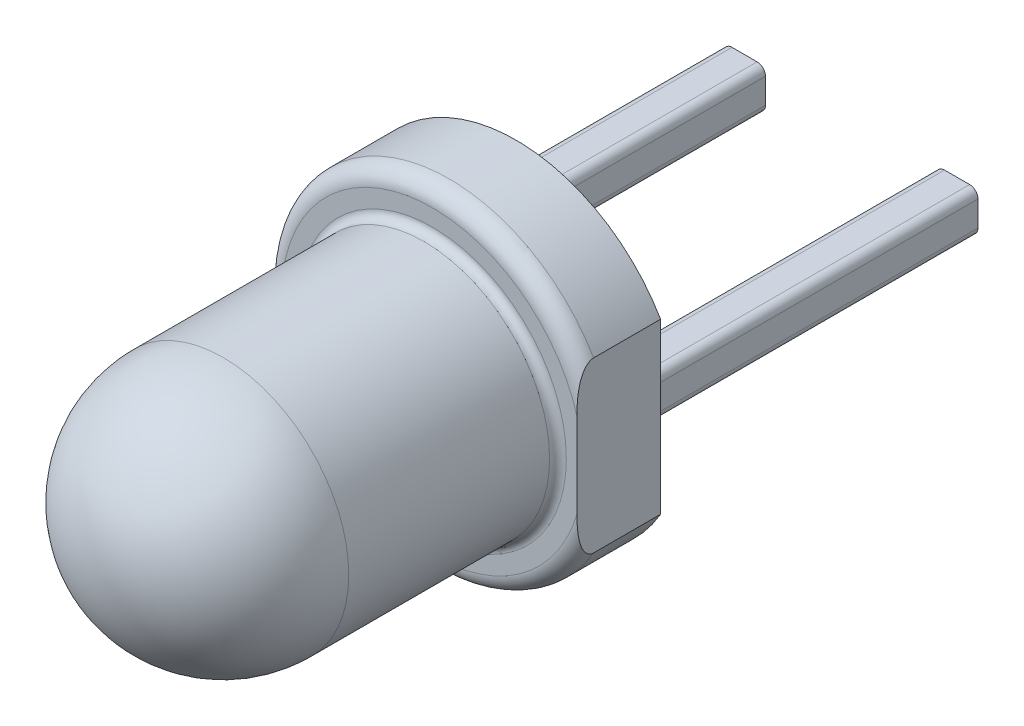
ISO-10303-21;
HEADER;
FILE_DESCRIPTION(('STEP AP214'),'2;1');
FILE_NAME('part.step','',(''),(''),'','','');
FILE_SCHEMA(('AUTOMOTIVE_DESIGN { 1 0 10303 214 1 1 1 1 }'));
ENDSEC;
DATA;
#1=APPLICATION_CONTEXT('core data for automotive mechanical design processes');
#2=APPLICATION_PROTOCOL_DEFINITION('international standard','automotive_design',2000,#1);
#3=PRODUCT_CONTEXT('',#1,'mechanical');
#4=PRODUCT('Part','Part','',(#3));
#5=PRODUCT_RELATED_PRODUCT_CATEGORY('part','',(#4));
#6=PRODUCT_DEFINITION_FORMATION('','',#4);
#7=PRODUCT_DEFINITION_CONTEXT('part definition',#1,'design');
#8=PRODUCT_DEFINITION('design','',#6,#7);
#9=PRODUCT_DEFINITION_SHAPE('','',#8);
#10=(LENGTH_UNIT() NAMED_UNIT(*) SI_UNIT(.MILLI.,.METRE.));
#11=(NAMED_UNIT(*) PLANE_ANGLE_UNIT() SI_UNIT($,.RADIAN.));
#12=(NAMED_UNIT(*) SI_UNIT($,.STERADIAN.) SOLID_ANGLE_UNIT());
#13=UNCERTAINTY_MEASURE_WITH_UNIT(LENGTH_MEASURE(1.E-05),#10,'distance_accuracy_value','');
#14=(GEOMETRIC_REPRESENTATION_CONTEXT(3) GLOBAL_UNCERTAINTY_ASSIGNED_CONTEXT((#13)) GLOBAL_UNIT_ASSIGNED_CONTEXT((#10,
#11,#12)) REPRESENTATION_CONTEXT('',''));
#15=CARTESIAN_POINT('',(0.,0.,0.));
#16=DIRECTION('',(0.,0.,1.));
#17=DIRECTION('',(1.,0.,0.));
#18=AXIS2_PLACEMENT_3D('',#15,#16,#17);
#19=CARTESIAN_POINT('',(0.,0.,0.));
#20=DIRECTION('',(0.,0.,1.));
#21=DIRECTION('',(1.,0.,0.));
#22=AXIS2_PLACEMENT_3D('',#19,#20,#21);
#23=PLANE('',#22);
#24=DIRECTION('',(0.,1.,0.));
#25=VECTOR('',#24,1.);
#26=CARTESIAN_POINT('',(-1.52,-0.25,0.));
#27=LINE('',#26,#25);
#28=CARTESIAN_POINT('',(-1.52,-0.15,0.));
#29=VERTEX_POINT('',#28);
#30=CARTESIAN_POINT('',(-1.52,0.15,0.));
#31=VERTEX_POINT('',#30);
#32=EDGE_CURVE('E282',#29,#31,#27,.T.);
#33=ORIENTED_EDGE('',*,*,#32,.F.);
#34=CARTESIAN_POINT('',(-1.42,-0.15,0.));
#35=DIRECTION('',(0.,0.,1.));
#36=DIRECTION('',(1.,0.,0.));
#37=AXIS2_PLACEMENT_3D('',#34,#35,#36);
#38=CIRCLE('',#37,0.1);
#39=CARTESIAN_POINT('',(-1.42,-0.25,0.));
#40=VERTEX_POINT('',#39);
#41=EDGE_CURVE('E268',#29,#40,#38,.T.);
#42=ORIENTED_EDGE('',*,*,#41,.T.);
#43=DIRECTION('',(-1.,0.,0.));
#44=VECTOR('',#43,1.);
#45=CARTESIAN_POINT('',(-1.02,-0.25,0.));
#46=LINE('',#45,#44);
#47=CARTESIAN_POINT('',(-1.12,-0.25,0.));
#48=VERTEX_POINT('',#47);
#49=EDGE_CURVE('E293',#48,#40,#46,.T.);
#50=ORIENTED_EDGE('',*,*,#49,.F.);
#51=CARTESIAN_POINT('',(-1.12,-0.15,0.));
#52=DIRECTION('',(0.,0.,1.));
#53=DIRECTION('',(1.,0.,0.));
#54=AXIS2_PLACEMENT_3D('',#51,#52,#53);
#55=CIRCLE('',#54,0.1);
#56=CARTESIAN_POINT('',(-1.02,-0.15,0.));
#57=VERTEX_POINT('',#56);
#58=EDGE_CURVE('E270',#48,#57,#55,.T.);
#59=ORIENTED_EDGE('',*,*,#58,.T.);
#60=DIRECTION('',(0.,-1.,0.));
#61=VECTOR('',#60,1.);
#62=CARTESIAN_POINT('',(-1.02,-0.25,0.));
#63=LINE('',#62,#61);
#64=CARTESIAN_POINT('',(-1.02,0.15,0.));
#65=VERTEX_POINT('',#64);
#66=EDGE_CURVE('E305',#65,#57,#63,.T.);
#67=ORIENTED_EDGE('',*,*,#66,.F.);
#68=CARTESIAN_POINT('',(-1.12,0.15,0.));
#69=DIRECTION('',(0.,0.,1.));
#70=DIRECTION('',(1.,0.,0.));
#71=AXIS2_PLACEMENT_3D('',#68,#69,#70);
#72=CIRCLE('',#71,0.1);
#73=CARTESIAN_POINT('',(-1.12,0.25,0.));
#74=VERTEX_POINT('',#73);
#75=EDGE_CURVE('E272',#65,#74,#72,.T.);
#76=ORIENTED_EDGE('',*,*,#75,.T.);
#77=DIRECTION('',(1.,0.,0.));
#78=VECTOR('',#77,1.);
#79=CARTESIAN_POINT('',(-1.02,0.25,0.));
#80=LINE('',#79,#78);
#81=CARTESIAN_POINT('',(-1.42,0.25,0.));
#82=VERTEX_POINT('',#81);
#83=EDGE_CURVE('E285',#82,#74,#80,.T.);
#84=ORIENTED_EDGE('',*,*,#83,.F.);
#85=CARTESIAN_POINT('',(-1.42,0.15,0.));
#86=DIRECTION('',(0.,0.,1.));
#87=DIRECTION('',(1.,0.,0.));
#88=AXIS2_PLACEMENT_3D('',#85,#86,#87);
#89=CIRCLE('',#88,0.1);
#90=EDGE_CURVE('E264',#82,#31,#89,.T.);
#91=ORIENTED_EDGE('',*,*,#90,.T.);
#92=EDGE_LOOP('',(#33,#42,#50,#59,#67,#76,#84,#91));
#93=FACE_BOUND('',#92,.T.);
#94=DIRECTION('',(0.,1.,0.));
#95=VECTOR('',#94,1.);
#96=CARTESIAN_POINT('',(1.02,-0.25,0.));
#97=LINE('',#96,#95);
#98=CARTESIAN_POINT('',(1.02,-0.15,0.));
#99=VERTEX_POINT('',#98);
#100=CARTESIAN_POINT('',(1.02,0.15,0.));
#101=VERTEX_POINT('',#100);
#102=EDGE_CURVE('E301',#99,#101,#97,.T.);
#103=ORIENTED_EDGE('',*,*,#102,.F.);
#104=CARTESIAN_POINT('',(1.12,-0.15,0.));
#105=DIRECTION('',(0.,0.,1.));
#106=DIRECTION('',(1.,0.,0.));
#107=AXIS2_PLACEMENT_3D('',#104,#105,#106);
#108=CIRCLE('',#107,0.1);
#109=CARTESIAN_POINT('',(1.12,-0.25,0.));
#110=VERTEX_POINT('',#109);
#111=EDGE_CURVE('E274',#99,#110,#108,.T.);
#112=ORIENTED_EDGE('',*,*,#111,.T.);
#113=DIRECTION('',(-1.,0.,0.));
#114=VECTOR('',#113,1.);
#115=CARTESIAN_POINT('',(1.52,-0.25,0.));
#116=LINE('',#115,#114);
#117=CARTESIAN_POINT('',(1.42,-0.25,0.));
#118=VERTEX_POINT('',#117);
#119=EDGE_CURVE('E196',#118,#110,#116,.T.);
#120=ORIENTED_EDGE('',*,*,#119,.F.);
#121=CARTESIAN_POINT('',(1.42,-0.15,0.));
#122=DIRECTION('',(0.,0.,1.));
#123=DIRECTION('',(1.,0.,0.));
#124=AXIS2_PLACEMENT_3D('',#121,#122,#123);
#125=CIRCLE('',#124,0.1);
#126=CARTESIAN_POINT('',(1.52,-0.15,0.));
#127=VERTEX_POINT('',#126);
#128=EDGE_CURVE('E62',#118,#127,#125,.T.);
#129=ORIENTED_EDGE('',*,*,#128,.T.);
#130=DIRECTION('',(0.,-1.,0.));
#131=VECTOR('',#130,1.);
#132=CARTESIAN_POINT('',(1.52,-0.25,0.));
#133=LINE('',#132,#131);
#134=CARTESIAN_POINT('',(1.52,0.15,0.));
#135=VERTEX_POINT('',#134);
#136=EDGE_CURVE('E322',#135,#127,#133,.T.);
#137=ORIENTED_EDGE('',*,*,#136,.F.);
#138=CARTESIAN_POINT('',(1.42,0.15,0.));
#139=DIRECTION('',(0.,0.,1.));
#140=DIRECTION('',(1.,0.,0.));
#141=AXIS2_PLACEMENT_3D('',#138,#139,#140);
#142=CIRCLE('',#141,0.1);
#143=CARTESIAN_POINT('',(1.42,0.25,0.));
#144=VERTEX_POINT('',#143);
#145=EDGE_CURVE('E276',#135,#144,#142,.T.);
#146=ORIENTED_EDGE('',*,*,#145,.T.);
#147=DIRECTION('',(1.,0.,0.));
#148=VECTOR('',#147,1.);
#149=CARTESIAN_POINT('',(1.52,0.25,0.));
#150=LINE('',#149,#148);
#151=CARTESIAN_POINT('',(1.12,0.25,0.));
#152=VERTEX_POINT('',#151);
#153=EDGE_CURVE('E320',#152,#144,#150,.T.);
#154=ORIENTED_EDGE('',*,*,#153,.F.);
#155=CARTESIAN_POINT('',(1.12,0.15,0.));
#156=DIRECTION('',(0.,0.,1.));
#157=DIRECTION('',(1.,0.,0.));
#158=AXIS2_PLACEMENT_3D('',#155,#156,#157);
#159=CIRCLE('',#158,0.1);
#160=EDGE_CURVE('E266',#152,#101,#159,.T.);
#161=ORIENTED_EDGE('',*,*,#160,.T.);
#162=EDGE_LOOP('',(#103,#112,#120,#129,#137,#146,#154,#161));
#163=FACE_BOUND('',#162,.T.);
#164=DIRECTION('',(0.,-1.,0.));
#165=VECTOR('',#164,1.);
#166=CARTESIAN_POINT('',(1.72664300141917,0.,0.));
#167=LINE('',#166,#165);
#168=CARTESIAN_POINT('',(1.72664300141917,1.0093086473672,0.));
#169=VERTEX_POINT('',#168);
#170=CARTESIAN_POINT('',(1.72664300141917,-1.0093086473672,0.));
#171=VERTEX_POINT('',#170);
#172=EDGE_CURVE('E169',#169,#171,#167,.T.);
#173=ORIENTED_EDGE('',*,*,#172,.T.);
#174=CARTESIAN_POINT('',(0.,0.,0.));
#175=DIRECTION('',(0.,0.,1.));
#176=DIRECTION('',(1.,0.,0.));
#177=AXIS2_PLACEMENT_3D('',#174,#175,#176);
#178=CIRCLE('',#177,2.);
#179=EDGE_CURVE('E182',#169,#171,#178,.T.);
#180=ORIENTED_EDGE('',*,*,#179,.F.);
#181=EDGE_LOOP('',(#173,#180));
#182=FACE_BOUND('',#181,.T.);
#183=ADVANCED_FACE('F34',(#93,#163,#182),#23,.F.);
#184=CARTESIAN_POINT('',(0.,0.,1.));
#185=DIRECTION('',(0.,0.,-1.));
#186=DIRECTION('',(-1.,0.,0.));
#187=AXIS2_PLACEMENT_3D('',#184,#185,#186);
#188=CYLINDRICAL_SURFACE('',#187,2.);
#189=DIRECTION('',(0.,0.,-1.));
#190=VECTOR('',#189,1.);
#191=CARTESIAN_POINT('',(1.72664300141917,-1.0093086473672,5.));
#192=LINE('',#191,#190);
#193=CARTESIAN_POINT('',(1.72664300141917,-1.0093086473672,0.8));
#194=VERTEX_POINT('',#193);
#195=EDGE_CURVE('E174',#194,#171,#192,.T.);
#196=ORIENTED_EDGE('',*,*,#195,.F.);
#197=CARTESIAN_POINT('',(0.,0.,0.8));
#198=DIRECTION('',(0.,0.,1.));
#199=DIRECTION('',(1.,0.,0.));
#200=AXIS2_PLACEMENT_3D('',#197,#198,#199);
#201=CIRCLE('',#200,2.);
#202=CARTESIAN_POINT('',(1.72664300141917,1.0093086473672,0.8));
#203=VERTEX_POINT('',#202);
#204=EDGE_CURVE('E184',#194,#203,#201,.F.);
#205=ORIENTED_EDGE('',*,*,#204,.T.);
#206=DIRECTION('',(0.,0.,-1.));
#207=VECTOR('',#206,1.);
#208=CARTESIAN_POINT('',(1.72664300141917,1.0093086473672,5.));
#209=LINE('',#208,#207);
#210=EDGE_CURVE('E172',#203,#169,#209,.T.);
#211=ORIENTED_EDGE('',*,*,#210,.T.);
#212=ORIENTED_EDGE('',*,*,#179,.T.);
#213=EDGE_LOOP('',(#196,#205,#211,#212));
#214=FACE_BOUND('',#213,.T.);
#215=ADVANCED_FACE('F181',(#214),#188,.T.);
#216=CARTESIAN_POINT('',(0.,0.,1.));
#217=DIRECTION('',(0.,0.,1.));
#218=DIRECTION('',(1.,0.,0.));
#219=AXIS2_PLACEMENT_3D('',#216,#217,#218);
#220=PLANE('',#219);
#221=CARTESIAN_POINT('',(0.,0.,1.));
#222=DIRECTION('',(0.,0.,1.));
#223=DIRECTION('',(1.,0.,0.));
#224=AXIS2_PLACEMENT_3D('',#221,#222,#223);
#225=CIRCLE('',#224,1.6);
#226=CARTESIAN_POINT('',(1.6,0.,1.));
#227=VERTEX_POINT('',#226);
#228=EDGE_CURVE('E205',#227,#227,#225,.F.);
#229=ORIENTED_EDGE('',*,*,#228,.T.);
#230=EDGE_LOOP('',(#229));
#231=FACE_BOUND('',#230,.T.);
#232=CARTESIAN_POINT('',(0.,0.,1.));
#233=DIRECTION('',(0.,0.,1.));
#234=DIRECTION('',(1.,0.,0.));
#235=AXIS2_PLACEMENT_3D('',#232,#233,#234);
#236=CIRCLE('',#235,1.8);
#237=CARTESIAN_POINT('',(1.72664300141917,0.508629477763723,1.));
#238=VERTEX_POINT('',#237);
#239=CARTESIAN_POINT('',(1.72664300141917,-0.508629477763723,1.));
#240=VERTEX_POINT('',#239);
#241=EDGE_CURVE('E190',#238,#240,#236,.T.);
#242=ORIENTED_EDGE('',*,*,#241,.T.);
#243=DIRECTION('',(0.,1.,0.));
#244=VECTOR('',#243,1.);
#245=CARTESIAN_POINT('',(1.72664300141917,0.,1.));
#246=LINE('',#245,#244);
#247=EDGE_CURVE('E54',#240,#238,#246,.T.);
#248=ORIENTED_EDGE('',*,*,#247,.T.);
#249=EDGE_LOOP('',(#242,#248));
#250=FACE_BOUND('',#249,.T.);
#251=ADVANCED_FACE('F281',(#231,#250),#220,.T.);
#252=CARTESIAN_POINT('',(0.,0.,0.8));
#253=DIRECTION('',(0.,0.,1.));
#254=DIRECTION('',(1.,0.,0.));
#255=AXIS2_PLACEMENT_3D('',#252,#253,#254);
#256=TOROIDAL_SURFACE('',#255,1.8,0.2);
#257=ORIENTED_EDGE('',*,*,#241,.F.);
#258=CARTESIAN_POINT('',(1.72664300141917,0.,0.986061147903619));
#259=CARTESIAN_POINT('',(1.72664300141917,0.0333415024761153,0.986061544030882));
#260=CARTESIAN_POINT('',(1.72664300141917,0.0666832136399586,0.986451436651125));
#261=CARTESIAN_POINT('',(1.72664300141917,0.133352669108265,0.987901461927297));
#262=CARTESIAN_POINT('',(1.72664300141917,0.166680412492658,0.9889616333743));
#263=CARTESIAN_POINT('',(1.72664300141917,0.244874709165764,0.991887473194281));
#264=CARTESIAN_POINT('',(1.72664300141917,0.289734624702239,0.993904980592459));
#265=CARTESIAN_POINT('',(1.72664300141917,0.379412631195158,0.997498828172326));
#266=CARTESIAN_POINT('',(1.72664300141917,0.424230686756442,0.999075812217728));
#267=CARTESIAN_POINT('',(1.72664300141917,0.506807790779325,1.00024280125669));
#268=CARTESIAN_POINT('',(1.72664300141917,0.544561318627415,1.00010780058603));
#269=CARTESIAN_POINT('',(1.72664300141917,0.620227835076793,0.997416300896036));
#270=CARTESIAN_POINT('',(1.72664300141917,0.658140578633229,0.994846678808751));
#271=CARTESIAN_POINT('',(1.72664300141917,0.715026606109995,0.987960283951824));
#272=CARTESIAN_POINT('',(1.72664300141917,0.734173757103309,0.985117428350001));
#273=CARTESIAN_POINT('',(1.72664300141917,0.772217936628769,0.97810214462332));
#274=CARTESIAN_POINT('',(1.72664300141917,0.791115144324387,0.973930729398989));
#275=CARTESIAN_POINT('',(1.72664300141917,0.82831141193828,0.963916199219986));
#276=CARTESIAN_POINT('',(1.72664300141917,0.846614022093343,0.958086575671044));
#277=CARTESIAN_POINT('',(1.72664300141917,0.882347129339379,0.944227030734735));
#278=CARTESIAN_POINT('',(1.72664300141917,0.899780437097689,0.936204829057426));
#279=CARTESIAN_POINT('',(1.72664300141917,0.926586624767936,0.920852449453963));
#280=CARTESIAN_POINT('',(1.72664300141917,0.936481173046221,0.914442419683775));
#281=CARTESIAN_POINT('',(1.72664300141917,0.955253709308694,0.900264342277539));
#282=CARTESIAN_POINT('',(1.72664300141917,0.964133942110263,0.892499393545432));
#283=CARTESIAN_POINT('',(1.72664300141917,0.977320213599598,0.87850881639288));
#284=CARTESIAN_POINT('',(1.72664300141917,0.982116349967206,0.872748021633222));
#285=CARTESIAN_POINT('',(1.72664300141917,0.990794151839405,0.860568313397488));
#286=CARTESIAN_POINT('',(1.72664300141917,0.994676901753378,0.854150193458266));
#287=CARTESIAN_POINT('',(1.72664300141917,1.0006428715448,0.841921192031011));
#288=CARTESIAN_POINT('',(1.72664300141917,1.00292392034514,0.836207756125545));
#289=CARTESIAN_POINT('',(1.72664300141917,1.00650212444368,0.824479787523179));
#290=CARTESIAN_POINT('',(1.72664300141917,1.0078002004459,0.818465542224352));
#291=CARTESIAN_POINT('',(1.72664300141917,1.00929969176256,0.806270135959106));
#292=CARTESIAN_POINT('',(1.72664300141917,1.00949591118273,0.800088322058984));
#293=CARTESIAN_POINT('',(1.72664300141917,1.00875747311893,0.787792446099958));
#294=CARTESIAN_POINT('',(1.72664300141917,1.00782254988201,0.781678400303253));
#295=CARTESIAN_POINT('',(1.72664300141917,1.00501369123797,0.770122811386287));
#296=CARTESIAN_POINT('',(1.72664300141917,1.00320904575847,0.764663982087235));
#297=CARTESIAN_POINT('',(1.72664300141917,0.998826829060329,0.754069908315535));
#298=CARTESIAN_POINT('',(1.72664300141917,0.996249002609373,0.748934771374395));
#299=CARTESIAN_POINT('',(1.72664300141917,0.988881367960597,0.736341480825572));
#300=CARTESIAN_POINT('',(1.72664300141917,0.983651453267976,0.729141147077253));
#301=CARTESIAN_POINT('',(1.72664300141917,0.972127824679989,0.715648328519937));
#302=CARTESIAN_POINT('',(1.72664300141917,0.965831129505052,0.709358482161698));
#303=CARTESIAN_POINT('',(1.72664300141917,0.948156018469856,0.693776954435807));
#304=CARTESIAN_POINT('',(1.72664300141917,0.936145205614662,0.6852087791876));
#305=CARTESIAN_POINT('',(1.72664300141917,0.911025415281376,0.669905487192914));
#306=CARTESIAN_POINT('',(1.72664300141917,0.897913962576939,0.663174655124705));
#307=CARTESIAN_POINT('',(1.72664300141917,0.871043155829629,0.651167387553289));
#308=CARTESIAN_POINT('',(1.72664300141917,0.857283408461528,0.645891848644545));
#309=CARTESIAN_POINT('',(1.72664300141917,0.829363845598357,0.636511119097173));
#310=CARTESIAN_POINT('',(1.72664300141917,0.815203596628591,0.632407254380548));
#311=CARTESIAN_POINT('',(1.72664300141917,0.772340774007088,0.621513792330328));
#312=CARTESIAN_POINT('',(1.72664300141917,0.743278835745518,0.616151424965169));
#313=CARTESIAN_POINT('',(1.72664300141917,0.682402154116103,0.6076796892912));
#314=CARTESIAN_POINT('',(1.72664300141917,0.650559996387063,0.604795560729433));
#315=CARTESIAN_POINT('',(1.72664300141917,0.586745886996138,0.601071252256435));
#316=CARTESIAN_POINT('',(1.72664300141917,0.554773856718907,0.600232586560585));
#317=CARTESIAN_POINT('',(1.72664300141917,0.45860293263749,0.599656691433911));
#318=CARTESIAN_POINT('',(1.72664300141917,0.394414098458645,0.601882636805279));
#319=CARTESIAN_POINT('',(1.72664300141917,0.26543879630254,0.60708772984626));
#320=CARTESIAN_POINT('',(1.72664300141917,0.200652947330631,0.610074364874782));
#321=CARTESIAN_POINT('',(1.72664300141917,0.10352864072194,0.612844283039163));
#322=CARTESIAN_POINT('',(1.72664300141917,0.0712234772573598,0.613482977096408));
#323=CARTESIAN_POINT('',(1.72664300141917,0.00660968310811095,0.614050141481815));
#324=CARTESIAN_POINT('',(1.72664300141917,-0.0256989472319333,0.613978656360094));
#325=CARTESIAN_POINT('',(1.72664300141917,-0.0902753638239309,0.613137338608984));
#326=CARTESIAN_POINT('',(1.72664300141917,-0.122543159181526,0.612368187060924));
#327=CARTESIAN_POINT('',(1.72664300141917,-0.187061658308165,0.610342218207515));
#328=CARTESIAN_POINT('',(1.72664300141917,-0.219312361665297,0.609085389640718));
#329=CARTESIAN_POINT('',(1.72664300141917,-0.316437800150604,0.605056742418041));
#330=CARTESIAN_POINT('',(1.72664300141917,-0.381306950815395,0.602038666982897));
#331=CARTESIAN_POINT('',(1.72664300141917,-0.478002727300532,0.600033532647638));
#332=CARTESIAN_POINT('',(1.72664300141917,-0.509793175587379,0.599775214941406));
#333=CARTESIAN_POINT('',(1.72664300141917,-0.573348802750172,0.600684340075581));
#334=CARTESIAN_POINT('',(1.72664300141917,-0.605113986141014,0.601851036352975));
#335=CARTESIAN_POINT('',(1.72664300141917,-0.668242251317108,0.606348069614508));
#336=CARTESIAN_POINT('',(1.72664300141917,-0.699606501064731,0.609660709745398));
#337=CARTESIAN_POINT('',(1.72664300141917,-0.761820020432959,0.61944593409895));
#338=CARTESIAN_POINT('',(1.72664300141917,-0.792670516762465,0.625909354855231));
#339=CARTESIAN_POINT('',(1.72664300141917,-0.836105659404903,0.638660551050898));
#340=CARTESIAN_POINT('',(1.72664300141917,-0.849250986625017,0.643022588126578));
#341=CARTESIAN_POINT('',(1.72664300141917,-0.875159725759936,0.65291251825127));
#342=CARTESIAN_POINT('',(1.72664300141917,-0.887921644590641,0.658444427219197));
#343=CARTESIAN_POINT('',(1.72664300141917,-0.912858914980203,0.670992512202739));
#344=CARTESIAN_POINT('',(1.72664300141917,-0.92502756243765,0.678022256129146));
#345=CARTESIAN_POINT('',(1.72664300141917,-0.948121725757943,0.693889660544481));
#346=CARTESIAN_POINT('',(1.72664300141917,-0.959052107289166,0.702719833819625));
#347=CARTESIAN_POINT('',(1.72664300141917,-0.974008542643836,0.717796153578155));
#348=CARTESIAN_POINT('',(1.72664300141917,-0.978830800327314,0.72324895995137));
#349=CARTESIAN_POINT('',(1.72664300141917,-0.987676713989902,0.734779231775221));
#350=CARTESIAN_POINT('',(1.72664300141917,-0.991700438830211,0.740856643294585));
#351=CARTESIAN_POINT('',(1.72664300141917,-0.998727959197846,0.753688022610263));
#352=CARTESIAN_POINT('',(1.72664300141917,-1.00171826598145,0.760449549618663));
#353=CARTESIAN_POINT('',(1.72664300141917,-1.00630388158852,0.774430133901732));
#354=CARTESIAN_POINT('',(1.72664300141917,-1.00790192385736,0.781648264684459));
#355=CARTESIAN_POINT('',(1.72664300141917,-1.00939852601437,0.795286801595498));
#356=CARTESIAN_POINT('',(1.72664300141917,-1.009494823714,0.801685646106904));
#357=CARTESIAN_POINT('',(1.72664300141917,-1.00848224759778,0.814387265555151));
#358=CARTESIAN_POINT('',(1.72664300141917,-1.00737318408027,0.820690025211681));
#359=CARTESIAN_POINT('',(1.72664300141917,-1.00422495788447,0.832394331395849));
#360=CARTESIAN_POINT('',(1.72664300141917,-1.00228685338787,0.837823878941503));
#361=CARTESIAN_POINT('',(1.72664300141917,-0.997655412397699,0.848346215673859));
#362=CARTESIAN_POINT('',(1.72664300141917,-0.994961904833715,0.853438928256869));
#363=CARTESIAN_POINT('',(1.72664300141917,-0.987213744569797,0.866095042299576));
#364=CARTESIAN_POINT('',(1.72664300141917,-0.98169647021961,0.873374899990403));
#365=CARTESIAN_POINT('',(1.72664300141917,-0.969593347083004,0.886984915452366));
#366=CARTESIAN_POINT('',(1.72664300141917,-0.963004438170262,0.893312250538701));
#367=CARTESIAN_POINT('',(1.72664300141917,-0.944430249461815,0.90906581603331));
#368=CARTESIAN_POINT('',(1.72664300141917,-0.931793664459479,0.91771778996626));
#369=CARTESIAN_POINT('',(1.72664300141917,-0.905420453135392,0.933103626114402));
#370=CARTESIAN_POINT('',(1.72664300141917,-0.891681218864247,0.939832758360143));
#371=CARTESIAN_POINT('',(1.72664300141917,-0.84916446931928,0.957933964633208));
#372=CARTESIAN_POINT('',(1.72664300141917,-0.819415916520537,0.966989392213113));
#373=CARTESIAN_POINT('',(1.72664300141917,-0.759044200963309,0.98117195373562));
#374=CARTESIAN_POINT('',(1.72664300141917,-0.728418862951462,0.98628824407979));
#375=CARTESIAN_POINT('',(1.72664300141917,-0.668844225964394,0.99359576650109));
#376=CARTESIAN_POINT('',(1.72664300141917,-0.639914571805639,0.99595471783561));
#377=CARTESIAN_POINT('',(1.72664300141917,-0.581961791590568,0.999039869509645));
#378=CARTESIAN_POINT('',(1.72664300141917,-0.552938614736173,0.999764939807907));
#379=CARTESIAN_POINT('',(1.72664300141917,-0.465874299423556,1.00032625499401));
#380=CARTESIAN_POINT('',(1.72664300141917,-0.407835704033953,0.998548819498196));
#381=CARTESIAN_POINT('',(1.72664300141917,-0.291499456824885,0.994045637342717));
#382=CARTESIAN_POINT('',(1.72664300141917,-0.23320216711445,0.991314653181456));
#383=CARTESIAN_POINT('',(1.72664300141917,-0.145738634589664,0.988302237510917));
#384=CARTESIAN_POINT('',(1.72664300141917,-0.116596740217888,0.987478926371191));
#385=CARTESIAN_POINT('',(1.72664300141917,-0.0583032836510623,0.986358211968353));
#386=CARTESIAN_POINT('',(1.72664300141917,-0.0291517215928504,0.986060801554749));
#387=CARTESIAN_POINT('',(1.72664300141917,0.,0.986061147903619));
#388=B_SPLINE_CURVE_WITH_KNOTS('',3,(#258,#259,#260,#261,#262,#263,#264,#265,#266,#267,#268,
#269,#270,#271,#272,#273,#274,#275,#276,#277,#278,#279,#280,#281,#282,#283,#284,#285,#286,#287,
#288,#289,#290,#291,#292,#293,#294,#295,#296,#297,#298,#299,#300,#301,#302,#303,#304,#305,#306,
#307,#308,#309,#310,#311,#312,#313,#314,#315,#316,#317,#318,#319,#320,#321,#322,#323,#324,#325,
#326,#327,#328,#329,#330,#331,#332,#333,#334,#335,#336,#337,#338,#339,#340,#341,#342,#343,#344,
#345,#346,#347,#348,#349,#350,#351,#352,#353,#354,#355,#356,#357,#358,#359,#360,#361,#362,#363,
#364,#365,#366,#367,#368,#369,#370,#371,#372,#373,#374,#375,#376,#377,#378,#379,#380,#381,#382,
#383,#384,#385,#386,#387),.UNSPECIFIED.,.T.,.F.,(4,2,2,2,2,2,2,2,2,2,2,2,2,2,2,2,2,2,2,2,2,2,2,
2,2,2,2,2,2,2,2,2,2,2,2,2,2,2,2,2,2,2,2,2,2,2,2,2,2,2,2,2,2,2,2,2,2,2,2,2,2,2,2,2,4),(0.,
0.100023194725668,0.200052178627715,0.334770880045077,0.469291635497252,0.582520194745527,
0.696362570351017,0.754399576431692,0.812392440303512,0.869926338221505,0.92726022166192,
0.962546850960859,0.997753807690063,1.02017696794114,1.04257337061441,1.06095422291433,
1.07931783737315,1.09776797469139,1.11622244756386,1.1334027511391,1.15058873230338,
1.17713371941533,1.20375415261917,1.2477661889448,1.29188000100872,1.3360209308466,
1.38021161643171,1.46866570585871,1.56449802861601,1.66040127262747,1.85300208496598,
2.04757730026836,2.14450207869264,2.24142077698528,2.33824496226488,2.43507138354391,
2.62986164314878,2.72521839604408,2.82052521307889,2.91505590455839,3.00931329646907,
3.05082431446848,3.09248021365753,3.13453083604423,3.17641002953987,3.19819288920474,
3.21997386961534,3.24202926761026,3.26404126582893,3.2831261100233,3.30221395825559,
3.31944356434787,3.33667707545383,3.36392282080914,3.39124778019188,3.43693203231201,
3.48272771360833,3.57549331402859,3.66851337411718,3.75551975296392,3.84258628959287,
4.016711347283,4.19180826063997,4.27926346678102,4.36671748381457),.UNSPECIFIED.);
#389=EDGE_CURVE('E11',#238,#203,#388,.T.);
#390=ORIENTED_EDGE('',*,*,#389,.T.);
#391=ORIENTED_EDGE('',*,*,#204,.F.);
#392=EDGE_CURVE('E38',#194,#240,#388,.T.);
#393=ORIENTED_EDGE('',*,*,#392,.T.);
#394=EDGE_LOOP('',(#257,#390,#391,#393));
#395=FACE_BOUND('',#394,.T.);
#396=ADVANCED_FACE('F279',(#395),#256,.T.);
#397=CARTESIAN_POINT('',(0.,0.,5.));
#398=DIRECTION('',(0.,0.,-1.));
#399=DIRECTION('',(-1.,0.,0.));
#400=AXIS2_PLACEMENT_3D('',#397,#398,#399);
#401=CYLINDRICAL_SURFACE('',#400,1.5);
#402=CARTESIAN_POINT('',(0.,0.,1.1));
#403=DIRECTION('',(0.,0.,1.));
#404=DIRECTION('',(1.,0.,0.));
#405=AXIS2_PLACEMENT_3D('',#402,#403,#404);
#406=CIRCLE('',#405,1.5);
#407=CARTESIAN_POINT('',(1.5,0.,1.1));
#408=VERTEX_POINT('',#407);
#409=EDGE_CURVE('E202',#408,#408,#406,.T.);
#410=ORIENTED_EDGE('',*,*,#409,.T.);
#411=EDGE_LOOP('',(#410));
#412=FACE_BOUND('',#411,.T.);
#413=CARTESIAN_POINT('',(0.,0.,3.5));
#414=DIRECTION('',(0.,0.,-1.));
#415=DIRECTION('',(-1.,0.,0.));
#416=AXIS2_PLACEMENT_3D('',#413,#414,#415);
#417=CIRCLE('',#416,1.5);
#418=CARTESIAN_POINT('',(-1.5,0.,3.5));
#419=VERTEX_POINT('',#418);
#420=EDGE_CURVE('E186',#419,#419,#417,.T.);
#421=ORIENTED_EDGE('',*,*,#420,.T.);
#422=EDGE_LOOP('',(#421));
#423=FACE_BOUND('',#422,.T.);
#424=ADVANCED_FACE('F377',(#412,#423),#401,.T.);
#425=CARTESIAN_POINT('',(0.,0.,3.5));
#426=DIRECTION('',(0.,0.,1.));
#427=DIRECTION('',(1.,0.,0.));
#428=AXIS2_PLACEMENT_3D('',#425,#426,#427);
#429=SPHERICAL_SURFACE('',#428,1.5);
#430=ORIENTED_EDGE('',*,*,#420,.F.);
#431=EDGE_LOOP('',(#430));
#432=FACE_BOUND('',#431,.T.);
#433=ADVANCED_FACE('F375',(#432),#429,.T.);
#434=CARTESIAN_POINT('',(1.02,-0.25,-4.));
#435=DIRECTION('',(1.,0.,0.));
#436=DIRECTION('',(0.,0.,-1.));
#437=AXIS2_PLACEMENT_3D('',#434,#435,#436);
#438=PLANE('',#437);
#439=ORIENTED_EDGE('',*,*,#102,.T.);
#440=DIRECTION('',(0.,0.,1.));
#441=VECTOR('',#440,1.);
#442=CARTESIAN_POINT('',(1.02,0.15,-4.));
#443=LINE('',#442,#441);
#444=CARTESIAN_POINT('',(1.02,0.15,-4.));
#445=VERTEX_POINT('',#444);
#446=EDGE_CURVE('E234',#101,#445,#443,.F.);
#447=ORIENTED_EDGE('',*,*,#446,.T.);
#448=DIRECTION('',(0.,1.,0.));
#449=VECTOR('',#448,1.);
#450=CARTESIAN_POINT('',(1.02,-0.25,-4.));
#451=LINE('',#450,#449);
#452=CARTESIAN_POINT('',(1.02,-0.15,-4.));
#453=VERTEX_POINT('',#452);
#454=EDGE_CURVE('E310',#453,#445,#451,.T.);
#455=ORIENTED_EDGE('',*,*,#454,.F.);
#456=DIRECTION('',(0.,0.,1.));
#457=VECTOR('',#456,1.);
#458=CARTESIAN_POINT('',(1.02,-0.15,-4.));
#459=LINE('',#458,#457);
#460=EDGE_CURVE('E231',#453,#99,#459,.T.);
#461=ORIENTED_EDGE('',*,*,#460,.T.);
#462=EDGE_LOOP('',(#439,#447,#455,#461));
#463=FACE_BOUND('',#462,.T.);
#464=ADVANCED_FACE('F340',(#463),#438,.F.);
#465=CARTESIAN_POINT('',(1.52,0.25,-4.));
#466=DIRECTION('',(0.,-1.,0.));
#467=DIRECTION('',(0.,0.,-1.));
#468=AXIS2_PLACEMENT_3D('',#465,#466,#467);
#469=PLANE('',#468);
#470=DIRECTION('',(1.,0.,0.));
#471=VECTOR('',#470,1.);
#472=CARTESIAN_POINT('',(1.52,0.25,-4.));
#473=LINE('',#472,#471);
#474=CARTESIAN_POINT('',(1.12,0.25,-4.));
#475=VERTEX_POINT('',#474);
#476=CARTESIAN_POINT('',(1.42,0.25,-4.));
#477=VERTEX_POINT('',#476);
#478=EDGE_CURVE('E313',#475,#477,#473,.T.);
#479=ORIENTED_EDGE('',*,*,#478,.F.);
#480=DIRECTION('',(0.,0.,1.));
#481=VECTOR('',#480,1.);
#482=CARTESIAN_POINT('',(1.12,0.25,-4.));
#483=LINE('',#482,#481);
#484=EDGE_CURVE('E228',#475,#152,#483,.T.);
#485=ORIENTED_EDGE('',*,*,#484,.T.);
#486=ORIENTED_EDGE('',*,*,#153,.T.);
#487=DIRECTION('',(0.,0.,1.));
#488=VECTOR('',#487,1.);
#489=CARTESIAN_POINT('',(1.42,0.25,-4.));
#490=LINE('',#489,#488);
#491=EDGE_CURVE('E226',#144,#477,#490,.F.);
#492=ORIENTED_EDGE('',*,*,#491,.T.);
#493=EDGE_LOOP('',(#479,#485,#486,#492));
#494=FACE_BOUND('',#493,.T.);
#495=ADVANCED_FACE('F349',(#494),#469,.F.);
#496=CARTESIAN_POINT('',(1.52,-0.25,-4.));
#497=DIRECTION('',(-1.,0.,0.));
#498=DIRECTION('',(0.,0.,1.));
#499=AXIS2_PLACEMENT_3D('',#496,#497,#498);
#500=PLANE('',#499);
#501=DIRECTION('',(0.,-1.,0.));
#502=VECTOR('',#501,1.);
#503=CARTESIAN_POINT('',(1.52,-0.25,-4.));
#504=LINE('',#503,#502);
#505=CARTESIAN_POINT('',(1.52,0.15,-4.));
#506=VERTEX_POINT('',#505);
#507=CARTESIAN_POINT('',(1.52,-0.15,-4.));
#508=VERTEX_POINT('',#507);
#509=EDGE_CURVE('E193',#506,#508,#504,.T.);
#510=ORIENTED_EDGE('',*,*,#509,.F.);
#511=DIRECTION('',(0.,0.,1.));
#512=VECTOR('',#511,1.);
#513=CARTESIAN_POINT('',(1.52,0.15,-4.));
#514=LINE('',#513,#512);
#515=EDGE_CURVE('E261',#506,#135,#514,.T.);
#516=ORIENTED_EDGE('',*,*,#515,.T.);
#517=ORIENTED_EDGE('',*,*,#136,.T.);
#518=DIRECTION('',(0.,0.,1.));
#519=VECTOR('',#518,1.);
#520=CARTESIAN_POINT('',(1.52,-0.15,-4.));
#521=LINE('',#520,#519);
#522=EDGE_CURVE('E259',#127,#508,#521,.F.);
#523=ORIENTED_EDGE('',*,*,#522,.T.);
#524=EDGE_LOOP('',(#510,#516,#517,#523));
#525=FACE_BOUND('',#524,.T.);
#526=ADVANCED_FACE('F357',(#525),#500,.F.);
#527=CARTESIAN_POINT('',(1.52,-0.25,-4.));
#528=DIRECTION('',(0.,1.,0.));
#529=DIRECTION('',(-1.,0.,0.));
#530=AXIS2_PLACEMENT_3D('',#527,#528,#529);
#531=PLANE('',#530);
#532=ORIENTED_EDGE('',*,*,#119,.T.);
#533=DIRECTION('',(0.,0.,1.));
#534=VECTOR('',#533,1.);
#535=CARTESIAN_POINT('',(1.12,-0.25,-4.));
#536=LINE('',#535,#534);
#537=CARTESIAN_POINT('',(1.12,-0.25,-4.));
#538=VERTEX_POINT('',#537);
#539=EDGE_CURVE('E257',#110,#538,#536,.F.);
#540=ORIENTED_EDGE('',*,*,#539,.T.);
#541=DIRECTION('',(-1.,0.,0.));
#542=VECTOR('',#541,1.);
#543=CARTESIAN_POINT('',(1.52,-0.25,-4.));
#544=LINE('',#543,#542);
#545=CARTESIAN_POINT('',(1.42,-0.25,-4.));
#546=VERTEX_POINT('',#545);
#547=EDGE_CURVE('E187',#546,#538,#544,.T.);
#548=ORIENTED_EDGE('',*,*,#547,.F.);
#549=DIRECTION('',(0.,0.,1.));
#550=VECTOR('',#549,1.);
#551=CARTESIAN_POINT('',(1.42,-0.25,-4.));
#552=LINE('',#551,#550);
#553=EDGE_CURVE('E254',#546,#118,#552,.T.);
#554=ORIENTED_EDGE('',*,*,#553,.T.);
#555=EDGE_LOOP('',(#532,#540,#548,#554));
#556=FACE_BOUND('',#555,.T.);
#557=ADVANCED_FACE('F328',(#556),#531,.F.);
#558=CARTESIAN_POINT('',(0.,0.,-4.));
#559=DIRECTION('',(0.,0.,1.));
#560=DIRECTION('',(1.,0.,0.));
#561=AXIS2_PLACEMENT_3D('',#558,#559,#560);
#562=PLANE('',#561);
#563=ORIENTED_EDGE('',*,*,#454,.T.);
#564=CARTESIAN_POINT('',(1.12,0.15,-4.));
#565=DIRECTION('',(0.,0.,1.));
#566=DIRECTION('',(1.,0.,0.));
#567=AXIS2_PLACEMENT_3D('',#564,#565,#566);
#568=CIRCLE('',#567,0.1);
#569=EDGE_CURVE('E242',#445,#475,#568,.F.);
#570=ORIENTED_EDGE('',*,*,#569,.T.);
#571=ORIENTED_EDGE('',*,*,#478,.T.);
#572=CARTESIAN_POINT('',(1.42,0.15,-4.));
#573=DIRECTION('',(0.,0.,1.));
#574=DIRECTION('',(1.,0.,0.));
#575=AXIS2_PLACEMENT_3D('',#572,#573,#574);
#576=CIRCLE('',#575,0.1);
#577=EDGE_CURVE('E238',#477,#506,#576,.F.);
#578=ORIENTED_EDGE('',*,*,#577,.T.);
#579=ORIENTED_EDGE('',*,*,#509,.T.);
#580=CARTESIAN_POINT('',(1.42,-0.15,-4.));
#581=DIRECTION('',(0.,0.,1.));
#582=DIRECTION('',(1.,0.,0.));
#583=AXIS2_PLACEMENT_3D('',#580,#581,#582);
#584=CIRCLE('',#583,0.1);
#585=EDGE_CURVE('E236',#508,#546,#584,.F.);
#586=ORIENTED_EDGE('',*,*,#585,.T.);
#587=ORIENTED_EDGE('',*,*,#547,.T.);
#588=CARTESIAN_POINT('',(1.12,-0.15,-4.));
#589=DIRECTION('',(0.,0.,1.));
#590=DIRECTION('',(1.,0.,0.));
#591=AXIS2_PLACEMENT_3D('',#588,#589,#590);
#592=CIRCLE('',#591,0.1);
#593=EDGE_CURVE('E240',#538,#453,#592,.F.);
#594=ORIENTED_EDGE('',*,*,#593,.T.);
#595=EDGE_LOOP('',(#563,#570,#571,#578,#579,#586,#587,#594));
#596=FACE_BOUND('',#595,.T.);
#597=ADVANCED_FACE('F337',(#596),#562,.F.);
#598=CARTESIAN_POINT('',(-1.52,-0.25,-4.));
#599=DIRECTION('',(1.,0.,0.));
#600=DIRECTION('',(0.,1.,0.));
#601=AXIS2_PLACEMENT_3D('',#598,#599,#600);
#602=PLANE('',#601);
#603=ORIENTED_EDGE('',*,*,#32,.T.);
#604=DIRECTION('',(0.,0.,1.));
#605=VECTOR('',#604,1.);
#606=CARTESIAN_POINT('',(-1.52,0.15,-4.));
#607=LINE('',#606,#605);
#608=CARTESIAN_POINT('',(-1.52,0.15,-4.));
#609=VERTEX_POINT('',#608);
#610=EDGE_CURVE('E216',#31,#609,#607,.F.);
#611=ORIENTED_EDGE('',*,*,#610,.T.);
#612=DIRECTION('',(0.,1.,0.));
#613=VECTOR('',#612,1.);
#614=CARTESIAN_POINT('',(-1.52,-0.25,-4.));
#615=LINE('',#614,#613);
#616=CARTESIAN_POINT('',(-1.52,-0.15,-4.));
#617=VERTEX_POINT('',#616);
#618=EDGE_CURVE('E289',#617,#609,#615,.T.);
#619=ORIENTED_EDGE('',*,*,#618,.F.);
#620=DIRECTION('',(0.,0.,1.));
#621=VECTOR('',#620,1.);
#622=CARTESIAN_POINT('',(-1.52,-0.15,-4.));
#623=LINE('',#622,#621);
#624=EDGE_CURVE('E213',#617,#29,#623,.T.);
#625=ORIENTED_EDGE('',*,*,#624,.T.);
#626=EDGE_LOOP('',(#603,#611,#619,#625));
#627=FACE_BOUND('',#626,.T.);
#628=ADVANCED_FACE('F491',(#627),#602,.F.);
#629=CARTESIAN_POINT('',(-1.02,0.25,-4.));
#630=DIRECTION('',(0.,-1.,0.));
#631=DIRECTION('',(0.,0.,-1.));
#632=AXIS2_PLACEMENT_3D('',#629,#630,#631);
#633=PLANE('',#632);
#634=DIRECTION('',(1.,0.,0.));
#635=VECTOR('',#634,1.);
#636=CARTESIAN_POINT('',(-1.02,0.25,-4.));
#637=LINE('',#636,#635);
#638=CARTESIAN_POINT('',(-1.42,0.25,-4.));
#639=VERTEX_POINT('',#638);
#640=CARTESIAN_POINT('',(-1.12,0.25,-4.));
#641=VERTEX_POINT('',#640);
#642=EDGE_CURVE('E292',#639,#641,#637,.T.);
#643=ORIENTED_EDGE('',*,*,#642,.F.);
#644=DIRECTION('',(0.,0.,1.));
#645=VECTOR('',#644,1.);
#646=CARTESIAN_POINT('',(-1.42,0.25,-4.));
#647=LINE('',#646,#645);
#648=EDGE_CURVE('E210',#639,#82,#647,.T.);
#649=ORIENTED_EDGE('',*,*,#648,.T.);
#650=ORIENTED_EDGE('',*,*,#83,.T.);
#651=DIRECTION('',(0.,0.,1.));
#652=VECTOR('',#651,1.);
#653=CARTESIAN_POINT('',(-1.12,0.25,-4.));
#654=LINE('',#653,#652);
#655=EDGE_CURVE('E208',#74,#641,#654,.F.);
#656=ORIENTED_EDGE('',*,*,#655,.T.);
#657=EDGE_LOOP('',(#643,#649,#650,#656));
#658=FACE_BOUND('',#657,.T.);
#659=ADVANCED_FACE('F498',(#658),#633,.F.);
#660=CARTESIAN_POINT('',(-1.02,-0.25,-4.));
#661=DIRECTION('',(-1.,0.,0.));
#662=DIRECTION('',(0.,0.,1.));
#663=AXIS2_PLACEMENT_3D('',#660,#661,#662);
#664=PLANE('',#663);
#665=ORIENTED_EDGE('',*,*,#66,.T.);
#666=DIRECTION('',(0.,0.,1.));
#667=VECTOR('',#666,1.);
#668=CARTESIAN_POINT('',(-1.02,-0.15,-4.));
#669=LINE('',#668,#667);
#670=CARTESIAN_POINT('',(-1.02,-0.15,-4.));
#671=VERTEX_POINT('',#670);
#672=EDGE_CURVE('E252',#57,#671,#669,.F.);
#673=ORIENTED_EDGE('',*,*,#672,.T.);
#674=DIRECTION('',(0.,-1.,0.));
#675=VECTOR('',#674,1.);
#676=CARTESIAN_POINT('',(-1.02,-0.25,-4.));
#677=LINE('',#676,#675);
#678=CARTESIAN_POINT('',(-1.02,0.15,-4.));
#679=VERTEX_POINT('',#678);
#680=EDGE_CURVE('E296',#679,#671,#677,.T.);
#681=ORIENTED_EDGE('',*,*,#680,.F.);
#682=DIRECTION('',(0.,0.,1.));
#683=VECTOR('',#682,1.);
#684=CARTESIAN_POINT('',(-1.02,0.15,-4.));
#685=LINE('',#684,#683);
#686=EDGE_CURVE('E249',#679,#65,#685,.T.);
#687=ORIENTED_EDGE('',*,*,#686,.T.);
#688=EDGE_LOOP('',(#665,#673,#681,#687));
#689=FACE_BOUND('',#688,.T.);
#690=ADVANCED_FACE('F506',(#689),#664,.F.);
#691=CARTESIAN_POINT('',(-1.02,-0.25,-4.));
#692=DIRECTION('',(0.,1.,0.));
#693=DIRECTION('',(0.,0.,1.));
#694=AXIS2_PLACEMENT_3D('',#691,#692,#693);
#695=PLANE('',#694);
#696=ORIENTED_EDGE('',*,*,#49,.T.);
#697=DIRECTION('',(0.,0.,1.));
#698=VECTOR('',#697,1.);
#699=CARTESIAN_POINT('',(-1.42,-0.25,-4.));
#700=LINE('',#699,#698);
#701=CARTESIAN_POINT('',(-1.42,-0.25,-4.));
#702=VERTEX_POINT('',#701);
#703=EDGE_CURVE('E247',#40,#702,#700,.F.);
#704=ORIENTED_EDGE('',*,*,#703,.T.);
#705=DIRECTION('',(-1.,0.,0.));
#706=VECTOR('',#705,1.);
#707=CARTESIAN_POINT('',(-1.02,-0.25,-4.));
#708=LINE('',#707,#706);
#709=CARTESIAN_POINT('',(-1.12,-0.25,-4.));
#710=VERTEX_POINT('',#709);
#711=EDGE_CURVE('E299',#710,#702,#708,.T.);
#712=ORIENTED_EDGE('',*,*,#711,.F.);
#713=DIRECTION('',(0.,0.,1.));
#714=VECTOR('',#713,1.);
#715=CARTESIAN_POINT('',(-1.12,-0.25,-4.));
#716=LINE('',#715,#714);
#717=EDGE_CURVE('E244',#710,#48,#716,.T.);
#718=ORIENTED_EDGE('',*,*,#717,.T.);
#719=EDGE_LOOP('',(#696,#704,#712,#718));
#720=FACE_BOUND('',#719,.T.);
#721=ADVANCED_FACE('F514',(#720),#695,.F.);
#722=CARTESIAN_POINT('',(0.,0.,-4.));
#723=DIRECTION('',(0.,0.,1.));
#724=DIRECTION('',(1.,0.,0.));
#725=AXIS2_PLACEMENT_3D('',#722,#723,#724);
#726=PLANE('',#725);
#727=ORIENTED_EDGE('',*,*,#618,.T.);
#728=CARTESIAN_POINT('',(-1.42,0.15,-4.));
#729=DIRECTION('',(0.,0.,1.));
#730=DIRECTION('',(1.,0.,0.));
#731=AXIS2_PLACEMENT_3D('',#728,#729,#730);
#732=CIRCLE('',#731,0.1);
#733=EDGE_CURVE('E224',#609,#639,#732,.F.);
#734=ORIENTED_EDGE('',*,*,#733,.T.);
#735=ORIENTED_EDGE('',*,*,#642,.T.);
#736=CARTESIAN_POINT('',(-1.12,0.15,-4.));
#737=DIRECTION('',(0.,0.,1.));
#738=DIRECTION('',(1.,0.,0.));
#739=AXIS2_PLACEMENT_3D('',#736,#737,#738);
#740=CIRCLE('',#739,0.1);
#741=EDGE_CURVE('E218',#641,#679,#740,.F.);
#742=ORIENTED_EDGE('',*,*,#741,.T.);
#743=ORIENTED_EDGE('',*,*,#680,.T.);
#744=CARTESIAN_POINT('',(-1.12,-0.15,-4.));
#745=DIRECTION('',(0.,0.,1.));
#746=DIRECTION('',(1.,0.,0.));
#747=AXIS2_PLACEMENT_3D('',#744,#745,#746);
#748=CIRCLE('',#747,0.1);
#749=EDGE_CURVE('E220',#671,#710,#748,.F.);
#750=ORIENTED_EDGE('',*,*,#749,.T.);
#751=ORIENTED_EDGE('',*,*,#711,.T.);
#752=CARTESIAN_POINT('',(-1.42,-0.15,-4.));
#753=DIRECTION('',(0.,0.,1.));
#754=DIRECTION('',(1.,0.,0.));
#755=AXIS2_PLACEMENT_3D('',#752,#753,#754);
#756=CIRCLE('',#755,0.1);
#757=EDGE_CURVE('E222',#702,#617,#756,.F.);
#758=ORIENTED_EDGE('',*,*,#757,.T.);
#759=EDGE_LOOP('',(#727,#734,#735,#742,#743,#750,#751,#758));
#760=FACE_BOUND('',#759,.T.);
#761=ADVANCED_FACE('F386',(#760),#726,.F.);
#762=CARTESIAN_POINT('',(0.,0.,1.1));
#763=DIRECTION('',(0.,0.,1.));
#764=DIRECTION('',(1.,0.,0.));
#765=AXIS2_PLACEMENT_3D('',#762,#763,#764);
#766=TOROIDAL_SURFACE('',#765,1.6,0.1);
#767=ORIENTED_EDGE('',*,*,#228,.F.);
#768=EDGE_LOOP('',(#767));
#769=FACE_BOUND('',#768,.T.);
#770=ORIENTED_EDGE('',*,*,#409,.F.);
#771=EDGE_LOOP('',(#770));
#772=FACE_BOUND('',#771,.T.);
#773=ADVANCED_FACE('F382',(#769,#772),#766,.F.);
#774=CARTESIAN_POINT('',(-1.42,0.15,-4.));
#775=DIRECTION('',(0.,0.,1.));
#776=DIRECTION('',(1.,0.,0.));
#777=AXIS2_PLACEMENT_3D('',#774,#775,#776);
#778=CYLINDRICAL_SURFACE('',#777,0.1);
#779=ORIENTED_EDGE('',*,*,#733,.F.);
#780=ORIENTED_EDGE('',*,*,#610,.F.);
#781=ORIENTED_EDGE('',*,*,#90,.F.);
#782=ORIENTED_EDGE('',*,*,#648,.F.);
#783=EDGE_LOOP('',(#779,#780,#781,#782));
#784=FACE_BOUND('',#783,.T.);
#785=ADVANCED_FACE('F385',(#784),#778,.T.);
#786=CARTESIAN_POINT('',(1.12,0.15,-4.));
#787=DIRECTION('',(0.,0.,1.));
#788=DIRECTION('',(1.,0.,0.));
#789=AXIS2_PLACEMENT_3D('',#786,#787,#788);
#790=CYLINDRICAL_SURFACE('',#789,0.1);
#791=ORIENTED_EDGE('',*,*,#569,.F.);
#792=ORIENTED_EDGE('',*,*,#446,.F.);
#793=ORIENTED_EDGE('',*,*,#160,.F.);
#794=ORIENTED_EDGE('',*,*,#484,.F.);
#795=EDGE_LOOP('',(#791,#792,#793,#794));
#796=FACE_BOUND('',#795,.T.);
#797=ADVANCED_FACE('F344',(#796),#790,.T.);
#798=CARTESIAN_POINT('',(-1.42,-0.15,-4.));
#799=DIRECTION('',(0.,0.,1.));
#800=DIRECTION('',(1.,0.,0.));
#801=AXIS2_PLACEMENT_3D('',#798,#799,#800);
#802=CYLINDRICAL_SURFACE('',#801,0.1);
#803=ORIENTED_EDGE('',*,*,#757,.F.);
#804=ORIENTED_EDGE('',*,*,#703,.F.);
#805=ORIENTED_EDGE('',*,*,#41,.F.);
#806=ORIENTED_EDGE('',*,*,#624,.F.);
#807=EDGE_LOOP('',(#803,#804,#805,#806));
#808=FACE_BOUND('',#807,.T.);
#809=ADVANCED_FACE('F393',(#808),#802,.T.);
#810=CARTESIAN_POINT('',(-1.12,-0.15,-4.));
#811=DIRECTION('',(0.,0.,1.));
#812=DIRECTION('',(1.,0.,0.));
#813=AXIS2_PLACEMENT_3D('',#810,#811,#812);
#814=CYLINDRICAL_SURFACE('',#813,0.1);
#815=ORIENTED_EDGE('',*,*,#749,.F.);
#816=ORIENTED_EDGE('',*,*,#672,.F.);
#817=ORIENTED_EDGE('',*,*,#58,.F.);
#818=ORIENTED_EDGE('',*,*,#717,.F.);
#819=EDGE_LOOP('',(#815,#816,#817,#818));
#820=FACE_BOUND('',#819,.T.);
#821=ADVANCED_FACE('F396',(#820),#814,.T.);
#822=CARTESIAN_POINT('',(-1.12,0.15,-4.));
#823=DIRECTION('',(0.,0.,1.));
#824=DIRECTION('',(1.,0.,0.));
#825=AXIS2_PLACEMENT_3D('',#822,#823,#824);
#826=CYLINDRICAL_SURFACE('',#825,0.1);
#827=ORIENTED_EDGE('',*,*,#741,.F.);
#828=ORIENTED_EDGE('',*,*,#655,.F.);
#829=ORIENTED_EDGE('',*,*,#75,.F.);
#830=ORIENTED_EDGE('',*,*,#686,.F.);
#831=EDGE_LOOP('',(#827,#828,#829,#830));
#832=FACE_BOUND('',#831,.T.);
#833=ADVANCED_FACE('F400',(#832),#826,.T.);
#834=CARTESIAN_POINT('',(1.12,-0.15,-4.));
#835=DIRECTION('',(0.,0.,1.));
#836=DIRECTION('',(1.,0.,0.));
#837=AXIS2_PLACEMENT_3D('',#834,#835,#836);
#838=CYLINDRICAL_SURFACE('',#837,0.1);
#839=ORIENTED_EDGE('',*,*,#593,.F.);
#840=ORIENTED_EDGE('',*,*,#539,.F.);
#841=ORIENTED_EDGE('',*,*,#111,.F.);
#842=ORIENTED_EDGE('',*,*,#460,.F.);
#843=EDGE_LOOP('',(#839,#840,#841,#842));
#844=FACE_BOUND('',#843,.T.);
#845=ADVANCED_FACE('F333',(#844),#838,.T.);
#846=CARTESIAN_POINT('',(1.42,0.15,-4.));
#847=DIRECTION('',(0.,0.,1.));
#848=DIRECTION('',(1.,0.,0.));
#849=AXIS2_PLACEMENT_3D('',#846,#847,#848);
#850=CYLINDRICAL_SURFACE('',#849,0.1);
#851=ORIENTED_EDGE('',*,*,#577,.F.);
#852=ORIENTED_EDGE('',*,*,#491,.F.);
#853=ORIENTED_EDGE('',*,*,#145,.F.);
#854=ORIENTED_EDGE('',*,*,#515,.F.);
#855=EDGE_LOOP('',(#851,#852,#853,#854));
#856=FACE_BOUND('',#855,.T.);
#857=ADVANCED_FACE('F353',(#856),#850,.T.);
#858=CARTESIAN_POINT('',(1.42,-0.15,-4.));
#859=DIRECTION('',(0.,0.,1.));
#860=DIRECTION('',(1.,0.,0.));
#861=AXIS2_PLACEMENT_3D('',#858,#859,#860);
#862=CYLINDRICAL_SURFACE('',#861,0.1);
#863=ORIENTED_EDGE('',*,*,#585,.F.);
#864=ORIENTED_EDGE('',*,*,#522,.F.);
#865=ORIENTED_EDGE('',*,*,#128,.F.);
#866=ORIENTED_EDGE('',*,*,#553,.F.);
#867=EDGE_LOOP('',(#863,#864,#865,#866));
#868=FACE_BOUND('',#867,.T.);
#869=ADVANCED_FACE('F36',(#868),#862,.T.);
#870=CARTESIAN_POINT('',(1.72664300141917,0.,5.));
#871=DIRECTION('',(1.,0.,0.));
#872=DIRECTION('',(0.,0.,-1.));
#873=AXIS2_PLACEMENT_3D('',#870,#871,#872);
#874=PLANE('',#873);
#875=ORIENTED_EDGE('',*,*,#247,.F.);
#876=ORIENTED_EDGE('',*,*,#392,.F.);
#877=ORIENTED_EDGE('',*,*,#195,.T.);
#878=ORIENTED_EDGE('',*,*,#172,.F.);
#879=ORIENTED_EDGE('',*,*,#210,.F.);
#880=ORIENTED_EDGE('',*,*,#389,.F.);
#881=EDGE_LOOP('',(#875,#876,#877,#878,#879,#880));
#882=FACE_BOUND('',#881,.T.);
#883=ADVANCED_FACE('F171',(#882),#874,.T.);
#884=CLOSED_SHELL('',(#183,#215,#251,#396,#424,#433,#464,#495,#526,#557,#597,#628,#659,#690,
#721,#761,#773,#785,#797,#809,#821,#833,#845,#857,#869,#883));
#885=MANIFOLD_SOLID_BREP('B2',#884);
#886=ADVANCED_BREP_SHAPE_REPRESENTATION('',(#18,#885),#14);
#887=SHAPE_DEFINITION_REPRESENTATION(#9,#886);
ENDSEC;
END-ISO-10303-21;
